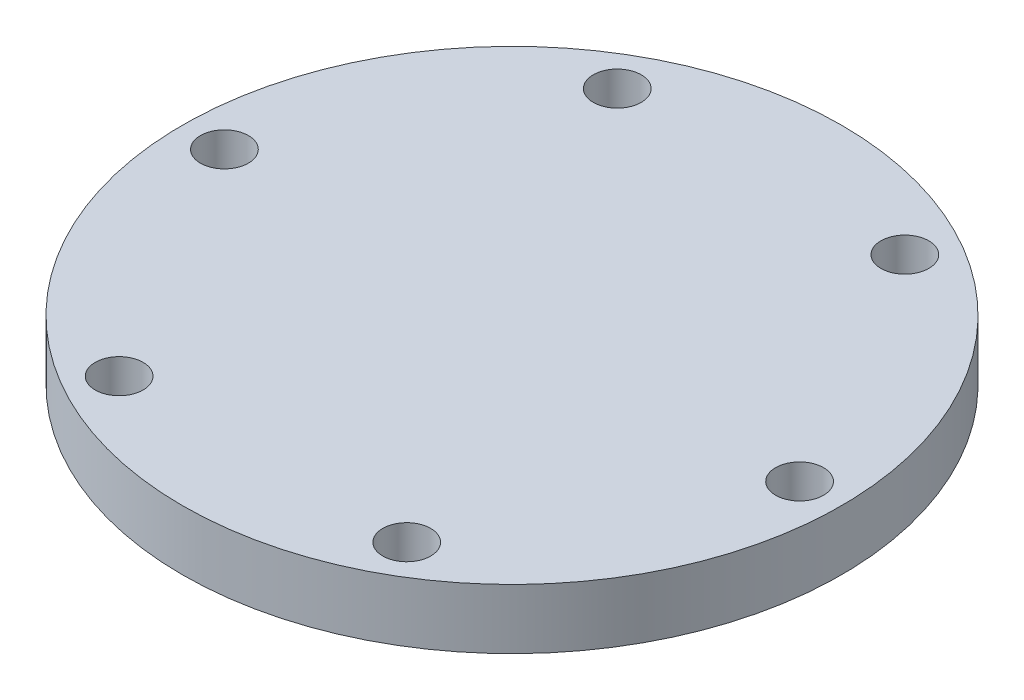
ISO-10303-21;
HEADER;
FILE_DESCRIPTION(('STEP AP214'),'2;1');
FILE_NAME('part.step','',(''),(''),'','','');
FILE_SCHEMA(('AUTOMOTIVE_DESIGN { 1 0 10303 214 1 1 1 1 }'));
ENDSEC;
DATA;
#1=APPLICATION_CONTEXT('core data for automotive mechanical design processes');
#2=APPLICATION_PROTOCOL_DEFINITION('international standard','automotive_design',2000,#1);
#3=PRODUCT_CONTEXT('',#1,'mechanical');
#4=PRODUCT('Part','Part','',(#3));
#5=PRODUCT_RELATED_PRODUCT_CATEGORY('part','',(#4));
#6=PRODUCT_DEFINITION_FORMATION('','',#4);
#7=PRODUCT_DEFINITION_CONTEXT('part definition',#1,'design');
#8=PRODUCT_DEFINITION('design','',#6,#7);
#9=PRODUCT_DEFINITION_SHAPE('','',#8);
#10=(LENGTH_UNIT() NAMED_UNIT(*) SI_UNIT(.MILLI.,.METRE.));
#11=(NAMED_UNIT(*) PLANE_ANGLE_UNIT() SI_UNIT($,.RADIAN.));
#12=(NAMED_UNIT(*) SI_UNIT($,.STERADIAN.) SOLID_ANGLE_UNIT());
#13=UNCERTAINTY_MEASURE_WITH_UNIT(LENGTH_MEASURE(1.E-05),#10,'distance_accuracy_value','');
#14=(GEOMETRIC_REPRESENTATION_CONTEXT(3) GLOBAL_UNCERTAINTY_ASSIGNED_CONTEXT((#13)) GLOBAL_UNIT_ASSIGNED_CONTEXT((#10,
#11,#12)) REPRESENTATION_CONTEXT('',''));
#15=CARTESIAN_POINT('',(0.,0.,0.));
#16=DIRECTION('',(0.,0.,1.));
#17=DIRECTION('',(1.,0.,0.));
#18=AXIS2_PLACEMENT_3D('',#15,#16,#17);
#19=CARTESIAN_POINT('',(11.9990879650761,5.,20.78303));
#20=DIRECTION('',(0.,-1.,0.));
#21=DIRECTION('',(0.,0.,-1.));
#22=AXIS2_PLACEMENT_3D('',#19,#20,#21);
#23=CYLINDRICAL_SURFACE('',#22,2.);
#24=CARTESIAN_POINT('',(11.9990879650761,5.,20.78303));
#25=DIRECTION('',(0.,1.,0.));
#26=DIRECTION('',(0.,0.,1.));
#27=AXIS2_PLACEMENT_3D('',#24,#25,#26);
#28=CIRCLE('',#27,2.);
#29=CARTESIAN_POINT('',(11.9990879650761,5.,22.78303));
#30=VERTEX_POINT('',#29);
#31=EDGE_CURVE('E52',#30,#30,#28,.T.);
#32=ORIENTED_EDGE('',*,*,#31,.T.);
#33=EDGE_LOOP('',(#32));
#34=FACE_BOUND('',#33,.T.);
#35=CARTESIAN_POINT('',(11.9990879650761,0.,20.78303));
#36=DIRECTION('',(0.,1.,0.));
#37=DIRECTION('',(0.,0.,1.));
#38=AXIS2_PLACEMENT_3D('',#35,#36,#37);
#39=CIRCLE('',#38,2.);
#40=CARTESIAN_POINT('',(11.9990879650761,0.,22.78303));
#41=VERTEX_POINT('',#40);
#42=EDGE_CURVE('E75',#41,#41,#39,.T.);
#43=ORIENTED_EDGE('',*,*,#42,.F.);
#44=EDGE_LOOP('',(#43));
#45=FACE_BOUND('',#44,.T.);
#46=ADVANCED_FACE('F44',(#34,#45),#23,.F.);
#47=CARTESIAN_POINT('',(23.9981759301521,5.,0.));
#48=DIRECTION('',(0.,-1.,0.));
#49=DIRECTION('',(0.,0.,-1.));
#50=AXIS2_PLACEMENT_3D('',#47,#48,#49);
#51=CYLINDRICAL_SURFACE('',#50,2.);
#52=CARTESIAN_POINT('',(23.9981759301521,5.,0.));
#53=DIRECTION('',(0.,1.,0.));
#54=DIRECTION('',(0.,0.,1.));
#55=AXIS2_PLACEMENT_3D('',#52,#53,#54);
#56=CIRCLE('',#55,2.);
#57=CARTESIAN_POINT('',(23.9981759301521,5.,2.));
#58=VERTEX_POINT('',#57);
#59=EDGE_CURVE('E57',#58,#58,#56,.T.);
#60=ORIENTED_EDGE('',*,*,#59,.T.);
#61=EDGE_LOOP('',(#60));
#62=FACE_BOUND('',#61,.T.);
#63=CARTESIAN_POINT('',(23.9981759301521,0.,0.));
#64=DIRECTION('',(0.,1.,0.));
#65=DIRECTION('',(0.,0.,1.));
#66=AXIS2_PLACEMENT_3D('',#63,#64,#65);
#67=CIRCLE('',#66,2.);
#68=CARTESIAN_POINT('',(23.9981759301521,0.,2.));
#69=VERTEX_POINT('',#68);
#70=EDGE_CURVE('E73',#69,#69,#67,.T.);
#71=ORIENTED_EDGE('',*,*,#70,.F.);
#72=EDGE_LOOP('',(#71));
#73=FACE_BOUND('',#72,.T.);
#74=ADVANCED_FACE('F99',(#62,#73),#51,.F.);
#75=CARTESIAN_POINT('',(11.9990879650761,5.,-20.78303));
#76=DIRECTION('',(0.,-1.,0.));
#77=DIRECTION('',(0.,0.,-1.));
#78=AXIS2_PLACEMENT_3D('',#75,#76,#77);
#79=CYLINDRICAL_SURFACE('',#78,2.);
#80=CARTESIAN_POINT('',(11.9990879650761,5.,-20.78303));
#81=DIRECTION('',(0.,1.,0.));
#82=DIRECTION('',(0.,0.,1.));
#83=AXIS2_PLACEMENT_3D('',#80,#81,#82);
#84=CIRCLE('',#83,2.);
#85=CARTESIAN_POINT('',(11.9990879650761,5.,-18.78303));
#86=VERTEX_POINT('',#85);
#87=EDGE_CURVE('E94',#86,#86,#84,.T.);
#88=ORIENTED_EDGE('',*,*,#87,.T.);
#89=EDGE_LOOP('',(#88));
#90=FACE_BOUND('',#89,.T.);
#91=CARTESIAN_POINT('',(11.9990879650761,0.,-20.78303));
#92=DIRECTION('',(0.,1.,0.));
#93=DIRECTION('',(0.,0.,1.));
#94=AXIS2_PLACEMENT_3D('',#91,#92,#93);
#95=CIRCLE('',#94,2.);
#96=CARTESIAN_POINT('',(11.9990879650761,0.,-18.78303));
#97=VERTEX_POINT('',#96);
#98=EDGE_CURVE('E70',#97,#97,#95,.T.);
#99=ORIENTED_EDGE('',*,*,#98,.F.);
#100=EDGE_LOOP('',(#99));
#101=FACE_BOUND('',#100,.T.);
#102=ADVANCED_FACE('F117',(#90,#101),#79,.F.);
#103=CARTESIAN_POINT('',(-11.9990879650761,5.,-20.78303));
#104=DIRECTION('',(0.,-1.,0.));
#105=DIRECTION('',(0.,0.,-1.));
#106=AXIS2_PLACEMENT_3D('',#103,#104,#105);
#107=CYLINDRICAL_SURFACE('',#106,2.);
#108=CARTESIAN_POINT('',(-11.9990879650761,5.,-20.78303));
#109=DIRECTION('',(0.,1.,0.));
#110=DIRECTION('',(0.,0.,1.));
#111=AXIS2_PLACEMENT_3D('',#108,#109,#110);
#112=CIRCLE('',#111,2.);
#113=CARTESIAN_POINT('',(-11.9990879650761,5.,-18.78303));
#114=VERTEX_POINT('',#113);
#115=EDGE_CURVE('E89',#114,#114,#112,.T.);
#116=ORIENTED_EDGE('',*,*,#115,.T.);
#117=EDGE_LOOP('',(#116));
#118=FACE_BOUND('',#117,.T.);
#119=CARTESIAN_POINT('',(-11.9990879650761,0.,-20.78303));
#120=DIRECTION('',(0.,1.,0.));
#121=DIRECTION('',(0.,0.,1.));
#122=AXIS2_PLACEMENT_3D('',#119,#120,#121);
#123=CIRCLE('',#122,2.);
#124=CARTESIAN_POINT('',(-11.9990879650761,0.,-18.78303));
#125=VERTEX_POINT('',#124);
#126=EDGE_CURVE('E67',#125,#125,#123,.T.);
#127=ORIENTED_EDGE('',*,*,#126,.F.);
#128=EDGE_LOOP('',(#127));
#129=FACE_BOUND('',#128,.T.);
#130=ADVANCED_FACE('F124',(#118,#129),#107,.F.);
#131=CARTESIAN_POINT('',(-23.9981759301521,5.,0.));
#132=DIRECTION('',(0.,-1.,0.));
#133=DIRECTION('',(0.,0.,-1.));
#134=AXIS2_PLACEMENT_3D('',#131,#132,#133);
#135=CYLINDRICAL_SURFACE('',#134,2.);
#136=CARTESIAN_POINT('',(-23.9981759301521,5.,0.));
#137=DIRECTION('',(0.,1.,0.));
#138=DIRECTION('',(0.,0.,1.));
#139=AXIS2_PLACEMENT_3D('',#136,#137,#138);
#140=CIRCLE('',#139,2.);
#141=CARTESIAN_POINT('',(-23.9981759301521,5.,2.));
#142=VERTEX_POINT('',#141);
#143=EDGE_CURVE('E84',#142,#142,#140,.T.);
#144=ORIENTED_EDGE('',*,*,#143,.T.);
#145=EDGE_LOOP('',(#144));
#146=FACE_BOUND('',#145,.T.);
#147=CARTESIAN_POINT('',(-23.9981759301521,0.,0.));
#148=DIRECTION('',(0.,1.,0.));
#149=DIRECTION('',(0.,0.,1.));
#150=AXIS2_PLACEMENT_3D('',#147,#148,#149);
#151=CIRCLE('',#150,2.);
#152=CARTESIAN_POINT('',(-23.9981759301521,0.,2.));
#153=VERTEX_POINT('',#152);
#154=EDGE_CURVE('E64',#153,#153,#151,.T.);
#155=ORIENTED_EDGE('',*,*,#154,.F.);
#156=EDGE_LOOP('',(#155));
#157=FACE_BOUND('',#156,.T.);
#158=ADVANCED_FACE('F127',(#146,#157),#135,.F.);
#159=CARTESIAN_POINT('',(-11.9990879650761,5.,20.78303));
#160=DIRECTION('',(0.,-1.,0.));
#161=DIRECTION('',(0.,0.,-1.));
#162=AXIS2_PLACEMENT_3D('',#159,#160,#161);
#163=CYLINDRICAL_SURFACE('',#162,2.);
#164=CARTESIAN_POINT('',(-11.9990879650761,5.,20.78303));
#165=DIRECTION('',(0.,1.,0.));
#166=DIRECTION('',(0.,0.,1.));
#167=AXIS2_PLACEMENT_3D('',#164,#165,#166);
#168=CIRCLE('',#167,2.);
#169=CARTESIAN_POINT('',(-11.9990879650761,5.,22.78303));
#170=VERTEX_POINT('',#169);
#171=EDGE_CURVE('E80',#170,#170,#168,.T.);
#172=ORIENTED_EDGE('',*,*,#171,.T.);
#173=EDGE_LOOP('',(#172));
#174=FACE_BOUND('',#173,.T.);
#175=CARTESIAN_POINT('',(-11.9990879650761,0.,20.78303));
#176=DIRECTION('',(0.,1.,0.));
#177=DIRECTION('',(0.,0.,1.));
#178=AXIS2_PLACEMENT_3D('',#175,#176,#177);
#179=CIRCLE('',#178,2.);
#180=CARTESIAN_POINT('',(-11.9990879650761,0.,22.78303));
#181=VERTEX_POINT('',#180);
#182=EDGE_CURVE('E61',#181,#181,#179,.T.);
#183=ORIENTED_EDGE('',*,*,#182,.F.);
#184=EDGE_LOOP('',(#183));
#185=FACE_BOUND('',#184,.T.);
#186=ADVANCED_FACE('F46',(#174,#185),#163,.F.);
#187=CARTESIAN_POINT('',(0.,5.,0.));
#188=DIRECTION('',(0.,-1.,0.));
#189=DIRECTION('',(0.,0.,-1.));
#190=AXIS2_PLACEMENT_3D('',#187,#188,#189);
#191=CYLINDRICAL_SURFACE('',#190,27.5);
#192=CARTESIAN_POINT('',(0.,5.,0.));
#193=DIRECTION('',(0.,1.,0.));
#194=DIRECTION('',(0.,0.,1.));
#195=AXIS2_PLACEMENT_3D('',#192,#193,#194);
#196=CIRCLE('',#195,27.5);
#197=CARTESIAN_POINT('',(0.,5.,27.5));
#198=VERTEX_POINT('',#197);
#199=EDGE_CURVE('E12',#198,#198,#196,.T.);
#200=ORIENTED_EDGE('',*,*,#199,.F.);
#201=EDGE_LOOP('',(#200));
#202=FACE_BOUND('',#201,.T.);
#203=CARTESIAN_POINT('',(0.,0.,0.));
#204=DIRECTION('',(0.,1.,0.));
#205=DIRECTION('',(0.,0.,1.));
#206=AXIS2_PLACEMENT_3D('',#203,#204,#205);
#207=CIRCLE('',#206,27.5);
#208=CARTESIAN_POINT('',(0.,0.,27.5));
#209=VERTEX_POINT('',#208);
#210=EDGE_CURVE('E48',#209,#209,#207,.T.);
#211=ORIENTED_EDGE('',*,*,#210,.T.);
#212=EDGE_LOOP('',(#211));
#213=FACE_BOUND('',#212,.T.);
#214=ADVANCED_FACE('F106',(#202,#213),#191,.T.);
#215=CARTESIAN_POINT('',(0.,5.,0.));
#216=DIRECTION('',(0.,1.,0.));
#217=DIRECTION('',(0.,0.,1.));
#218=AXIS2_PLACEMENT_3D('',#215,#216,#217);
#219=PLANE('',#218);
#220=ORIENTED_EDGE('',*,*,#171,.F.);
#221=EDGE_LOOP('',(#220));
#222=FACE_BOUND('',#221,.T.);
#223=ORIENTED_EDGE('',*,*,#143,.F.);
#224=EDGE_LOOP('',(#223));
#225=FACE_BOUND('',#224,.T.);
#226=ORIENTED_EDGE('',*,*,#115,.F.);
#227=EDGE_LOOP('',(#226));
#228=FACE_BOUND('',#227,.T.);
#229=ORIENTED_EDGE('',*,*,#87,.F.);
#230=EDGE_LOOP('',(#229));
#231=FACE_BOUND('',#230,.T.);
#232=ORIENTED_EDGE('',*,*,#59,.F.);
#233=EDGE_LOOP('',(#232));
#234=FACE_BOUND('',#233,.T.);
#235=ORIENTED_EDGE('',*,*,#31,.F.);
#236=EDGE_LOOP('',(#235));
#237=FACE_BOUND('',#236,.T.);
#238=ORIENTED_EDGE('',*,*,#199,.T.);
#239=EDGE_LOOP('',(#238));
#240=FACE_BOUND('',#239,.T.);
#241=ADVANCED_FACE('F102',(#222,#225,#228,#231,#234,#237,#240),#219,.T.);
#242=CARTESIAN_POINT('',(0.,0.,0.));
#243=DIRECTION('',(0.,1.,0.));
#244=DIRECTION('',(0.,0.,1.));
#245=AXIS2_PLACEMENT_3D('',#242,#243,#244);
#246=PLANE('',#245);
#247=ORIENTED_EDGE('',*,*,#182,.T.);
#248=EDGE_LOOP('',(#247));
#249=FACE_BOUND('',#248,.T.);
#250=ORIENTED_EDGE('',*,*,#154,.T.);
#251=EDGE_LOOP('',(#250));
#252=FACE_BOUND('',#251,.T.);
#253=ORIENTED_EDGE('',*,*,#126,.T.);
#254=EDGE_LOOP('',(#253));
#255=FACE_BOUND('',#254,.T.);
#256=ORIENTED_EDGE('',*,*,#98,.T.);
#257=EDGE_LOOP('',(#256));
#258=FACE_BOUND('',#257,.T.);
#259=ORIENTED_EDGE('',*,*,#70,.T.);
#260=EDGE_LOOP('',(#259));
#261=FACE_BOUND('',#260,.T.);
#262=ORIENTED_EDGE('',*,*,#42,.T.);
#263=EDGE_LOOP('',(#262));
#264=FACE_BOUND('',#263,.T.);
#265=ORIENTED_EDGE('',*,*,#210,.F.);
#266=EDGE_LOOP('',(#265));
#267=FACE_BOUND('',#266,.T.);
#268=ADVANCED_FACE('F105',(#249,#252,#255,#258,#261,#264,#267),#246,.F.);
#269=CLOSED_SHELL('',(#46,#74,#102,#130,#158,#186,#214,#241,#268));
#270=MANIFOLD_SOLID_BREP('B2',#269);
#271=ADVANCED_BREP_SHAPE_REPRESENTATION('',(#18,#270),#14);
#272=SHAPE_DEFINITION_REPRESENTATION(#9,#271);
ENDSEC;
END-ISO-10303-21;
